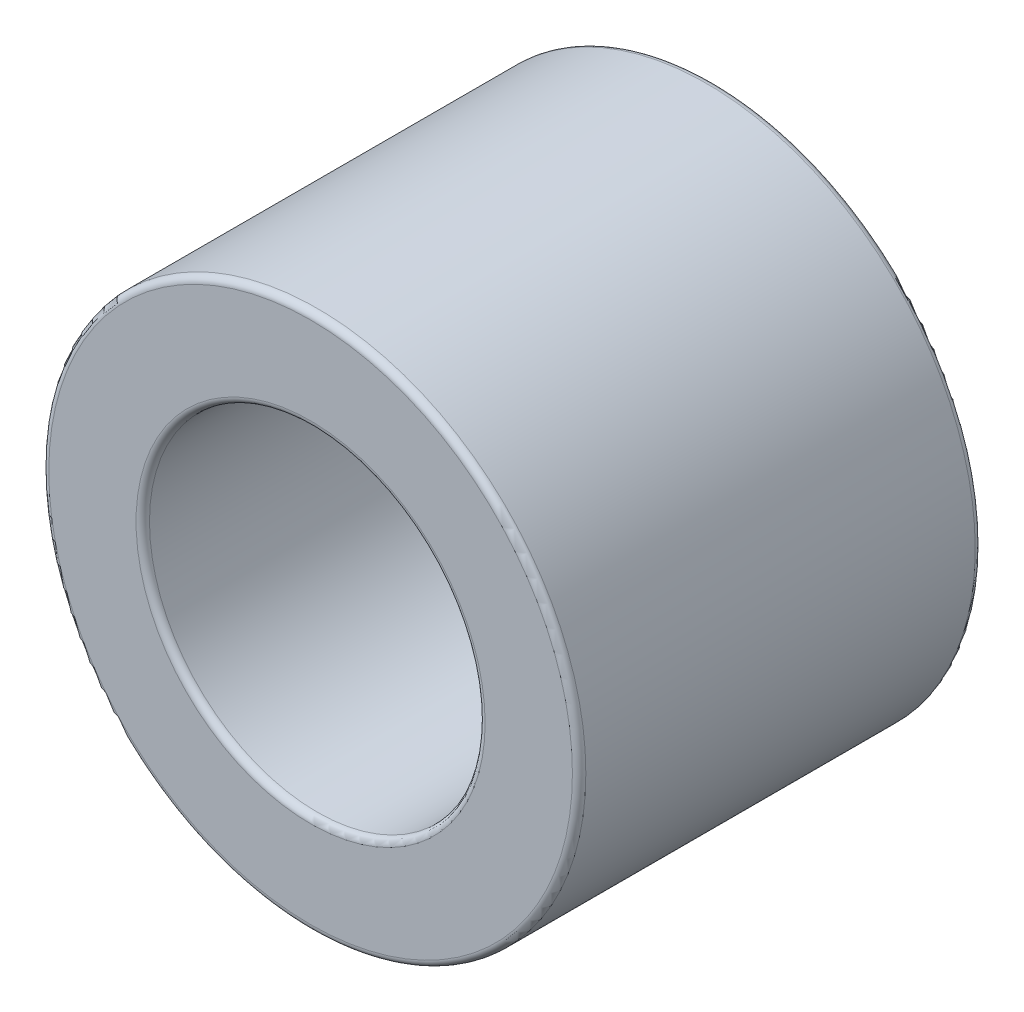
ISO-10303-21;
HEADER;
FILE_DESCRIPTION(('STEP AP214'),'2;1');
FILE_NAME('part.step','',(''),(''),'','','');
FILE_SCHEMA(('AUTOMOTIVE_DESIGN { 1 0 10303 214 1 1 1 1 }'));
ENDSEC;
DATA;
#1=APPLICATION_CONTEXT('core data for automotive mechanical design processes');
#2=APPLICATION_PROTOCOL_DEFINITION('international standard','automotive_design',2000,#1);
#3=PRODUCT_CONTEXT('',#1,'mechanical');
#4=PRODUCT('Part','Part','',(#3));
#5=PRODUCT_RELATED_PRODUCT_CATEGORY('part','',(#4));
#6=PRODUCT_DEFINITION_FORMATION('','',#4);
#7=PRODUCT_DEFINITION_CONTEXT('part definition',#1,'design');
#8=PRODUCT_DEFINITION('design','',#6,#7);
#9=PRODUCT_DEFINITION_SHAPE('','',#8);
#10=(LENGTH_UNIT() NAMED_UNIT(*) SI_UNIT(.MILLI.,.METRE.));
#11=(NAMED_UNIT(*) PLANE_ANGLE_UNIT() SI_UNIT($,.RADIAN.));
#12=(NAMED_UNIT(*) SI_UNIT($,.STERADIAN.) SOLID_ANGLE_UNIT());
#13=UNCERTAINTY_MEASURE_WITH_UNIT(LENGTH_MEASURE(1.E-05),#10,'distance_accuracy_value','');
#14=(GEOMETRIC_REPRESENTATION_CONTEXT(3) GLOBAL_UNCERTAINTY_ASSIGNED_CONTEXT((#13)) GLOBAL_UNIT_ASSIGNED_CONTEXT((#10,
#11,#12)) REPRESENTATION_CONTEXT('',''));
#15=CARTESIAN_POINT('',(0.,0.,0.));
#16=DIRECTION('',(0.,0.,1.));
#17=DIRECTION('',(1.,0.,0.));
#18=AXIS2_PLACEMENT_3D('',#15,#16,#17);
#19=CARTESIAN_POINT('',(0.,0.,6.));
#20=DIRECTION('',(0.,0.,1.));
#21=DIRECTION('',(1.,0.,0.));
#22=AXIS2_PLACEMENT_3D('',#19,#20,#21);
#23=PLANE('',#22);
#24=CARTESIAN_POINT('',(0.,0.,6.));
#25=DIRECTION('',(0.,0.,1.));
#26=DIRECTION('',(1.,0.,0.));
#27=AXIS2_PLACEMENT_3D('',#24,#25,#26);
#28=CIRCLE('',#27,2.6);
#29=CARTESIAN_POINT('',(2.6,0.,6.));
#30=VERTEX_POINT('',#29);
#31=EDGE_CURVE('E10',#30,#30,#28,.F.);
#32=ORIENTED_EDGE('',*,*,#31,.T.);
#33=EDGE_LOOP('',(#32));
#34=FACE_BOUND('',#33,.T.);
#35=CARTESIAN_POINT('',(0.,0.,6.));
#36=DIRECTION('',(0.,0.,1.));
#37=DIRECTION('',(1.,0.,0.));
#38=AXIS2_PLACEMENT_3D('',#35,#36,#37);
#39=CIRCLE('',#38,3.9);
#40=CARTESIAN_POINT('',(3.9,0.,6.));
#41=VERTEX_POINT('',#40);
#42=EDGE_CURVE('E45',#41,#41,#39,.T.);
#43=ORIENTED_EDGE('',*,*,#42,.T.);
#44=EDGE_LOOP('',(#43));
#45=FACE_BOUND('',#44,.T.);
#46=ADVANCED_FACE('F37',(#34,#45),#23,.T.);
#47=CARTESIAN_POINT('',(0.,0.,0.));
#48=DIRECTION('',(0.,0.,1.));
#49=DIRECTION('',(1.,0.,0.));
#50=AXIS2_PLACEMENT_3D('',#47,#48,#49);
#51=PLANE('',#50);
#52=CARTESIAN_POINT('',(0.,0.,0.));
#53=DIRECTION('',(0.,0.,1.));
#54=DIRECTION('',(1.,0.,0.));
#55=AXIS2_PLACEMENT_3D('',#52,#53,#54);
#56=CIRCLE('',#55,2.6);
#57=CARTESIAN_POINT('',(2.6,0.,0.));
#58=VERTEX_POINT('',#57);
#59=EDGE_CURVE('E69',#58,#58,#56,.T.);
#60=ORIENTED_EDGE('',*,*,#59,.T.);
#61=EDGE_LOOP('',(#60));
#62=FACE_BOUND('',#61,.T.);
#63=CARTESIAN_POINT('',(0.,0.,0.));
#64=DIRECTION('',(0.,0.,1.));
#65=DIRECTION('',(1.,0.,0.));
#66=AXIS2_PLACEMENT_3D('',#63,#64,#65);
#67=CIRCLE('',#66,3.9);
#68=CARTESIAN_POINT('',(3.9,0.,0.));
#69=VERTEX_POINT('',#68);
#70=EDGE_CURVE('E73',#69,#69,#67,.F.);
#71=ORIENTED_EDGE('',*,*,#70,.T.);
#72=EDGE_LOOP('',(#71));
#73=FACE_BOUND('',#72,.T.);
#74=ADVANCED_FACE('F78',(#62,#73),#51,.F.);
#75=CARTESIAN_POINT('',(0.,0.,6.));
#76=DIRECTION('',(0.,0.,-1.));
#77=DIRECTION('',(-1.,0.,0.));
#78=AXIS2_PLACEMENT_3D('',#75,#76,#77);
#79=CYLINDRICAL_SURFACE('',#78,4.);
#80=CARTESIAN_POINT('',(0.,0.,0.1));
#81=DIRECTION('',(0.,0.,1.));
#82=DIRECTION('',(1.,0.,0.));
#83=AXIS2_PLACEMENT_3D('',#80,#81,#82);
#84=CIRCLE('',#83,4.);
#85=CARTESIAN_POINT('',(4.,0.,0.1));
#86=VERTEX_POINT('',#85);
#87=EDGE_CURVE('E50',#86,#86,#84,.T.);
#88=ORIENTED_EDGE('',*,*,#87,.T.);
#89=EDGE_LOOP('',(#88));
#90=FACE_BOUND('',#89,.T.);
#91=CARTESIAN_POINT('',(0.,0.,5.9));
#92=DIRECTION('',(0.,0.,1.));
#93=DIRECTION('',(1.,0.,0.));
#94=AXIS2_PLACEMENT_3D('',#91,#92,#93);
#95=CIRCLE('',#94,4.);
#96=CARTESIAN_POINT('',(4.,0.,5.9));
#97=VERTEX_POINT('',#96);
#98=EDGE_CURVE('E55',#97,#97,#95,.F.);
#99=ORIENTED_EDGE('',*,*,#98,.T.);
#100=EDGE_LOOP('',(#99));
#101=FACE_BOUND('',#100,.T.);
#102=ADVANCED_FACE('F88',(#90,#101),#79,.T.);
#103=CARTESIAN_POINT('',(0.,0.,6.));
#104=DIRECTION('',(0.,0.,-1.));
#105=DIRECTION('',(-1.,0.,0.));
#106=AXIS2_PLACEMENT_3D('',#103,#104,#105);
#107=CYLINDRICAL_SURFACE('',#106,2.5);
#108=CARTESIAN_POINT('',(0.,0.,0.1));
#109=DIRECTION('',(0.,0.,1.));
#110=DIRECTION('',(1.,0.,0.));
#111=AXIS2_PLACEMENT_3D('',#108,#109,#110);
#112=CIRCLE('',#111,2.5);
#113=CARTESIAN_POINT('',(2.5,0.,0.1));
#114=VERTEX_POINT('',#113);
#115=EDGE_CURVE('E61',#114,#114,#112,.F.);
#116=ORIENTED_EDGE('',*,*,#115,.T.);
#117=EDGE_LOOP('',(#116));
#118=FACE_BOUND('',#117,.T.);
#119=CARTESIAN_POINT('',(0.,0.,5.9));
#120=DIRECTION('',(0.,0.,1.));
#121=DIRECTION('',(1.,0.,0.));
#122=AXIS2_PLACEMENT_3D('',#119,#120,#121);
#123=CIRCLE('',#122,2.5);
#124=CARTESIAN_POINT('',(2.5,0.,5.9));
#125=VERTEX_POINT('',#124);
#126=EDGE_CURVE('E65',#125,#125,#123,.T.);
#127=ORIENTED_EDGE('',*,*,#126,.T.);
#128=EDGE_LOOP('',(#127));
#129=FACE_BOUND('',#128,.T.);
#130=ADVANCED_FACE('F91',(#118,#129),#107,.F.);
#131=CARTESIAN_POINT('',(0.,0.,0.1));
#132=DIRECTION('',(0.,0.,1.));
#133=DIRECTION('',(1.,0.,0.));
#134=AXIS2_PLACEMENT_3D('',#131,#132,#133);
#135=TOROIDAL_SURFACE('',#134,2.6,0.1);
#136=ORIENTED_EDGE('',*,*,#115,.F.);
#137=EDGE_LOOP('',(#136));
#138=FACE_BOUND('',#137,.T.);
#139=ORIENTED_EDGE('',*,*,#59,.F.);
#140=EDGE_LOOP('',(#139));
#141=FACE_BOUND('',#140,.T.);
#142=ADVANCED_FACE('F84',(#138,#141),#135,.T.);
#143=CARTESIAN_POINT('',(0.,0.,0.1));
#144=DIRECTION('',(0.,0.,1.));
#145=DIRECTION('',(1.,0.,0.));
#146=AXIS2_PLACEMENT_3D('',#143,#144,#145);
#147=TOROIDAL_SURFACE('',#146,3.9,0.1);
#148=ORIENTED_EDGE('',*,*,#70,.F.);
#149=EDGE_LOOP('',(#148));
#150=FACE_BOUND('',#149,.T.);
#151=ORIENTED_EDGE('',*,*,#87,.F.);
#152=EDGE_LOOP('',(#151));
#153=FACE_BOUND('',#152,.T.);
#154=ADVANCED_FACE('F80',(#150,#153),#147,.T.);
#155=CARTESIAN_POINT('',(0.,0.,5.9));
#156=DIRECTION('',(0.,0.,1.));
#157=DIRECTION('',(1.,0.,0.));
#158=AXIS2_PLACEMENT_3D('',#155,#156,#157);
#159=TOROIDAL_SURFACE('',#158,2.6,0.1);
#160=ORIENTED_EDGE('',*,*,#31,.F.);
#161=EDGE_LOOP('',(#160));
#162=FACE_BOUND('',#161,.T.);
#163=ORIENTED_EDGE('',*,*,#126,.F.);
#164=EDGE_LOOP('',(#163));
#165=FACE_BOUND('',#164,.T.);
#166=ADVANCED_FACE('F83',(#162,#165),#159,.T.);
#167=CARTESIAN_POINT('',(0.,0.,5.9));
#168=DIRECTION('',(0.,0.,1.));
#169=DIRECTION('',(1.,0.,0.));
#170=AXIS2_PLACEMENT_3D('',#167,#168,#169);
#171=TOROIDAL_SURFACE('',#170,3.9,0.1);
#172=ORIENTED_EDGE('',*,*,#98,.F.);
#173=EDGE_LOOP('',(#172));
#174=FACE_BOUND('',#173,.T.);
#175=ORIENTED_EDGE('',*,*,#42,.F.);
#176=EDGE_LOOP('',(#175));
#177=FACE_BOUND('',#176,.T.);
#178=ADVANCED_FACE('F39',(#174,#177),#171,.T.);
#179=CLOSED_SHELL('',(#46,#74,#102,#130,#142,#154,#166,#178));
#180=MANIFOLD_SOLID_BREP('B2',#179);
#181=ADVANCED_BREP_SHAPE_REPRESENTATION('',(#18,#180),#14);
#182=SHAPE_DEFINITION_REPRESENTATION(#9,#181);
ENDSEC;
END-ISO-10303-21;
